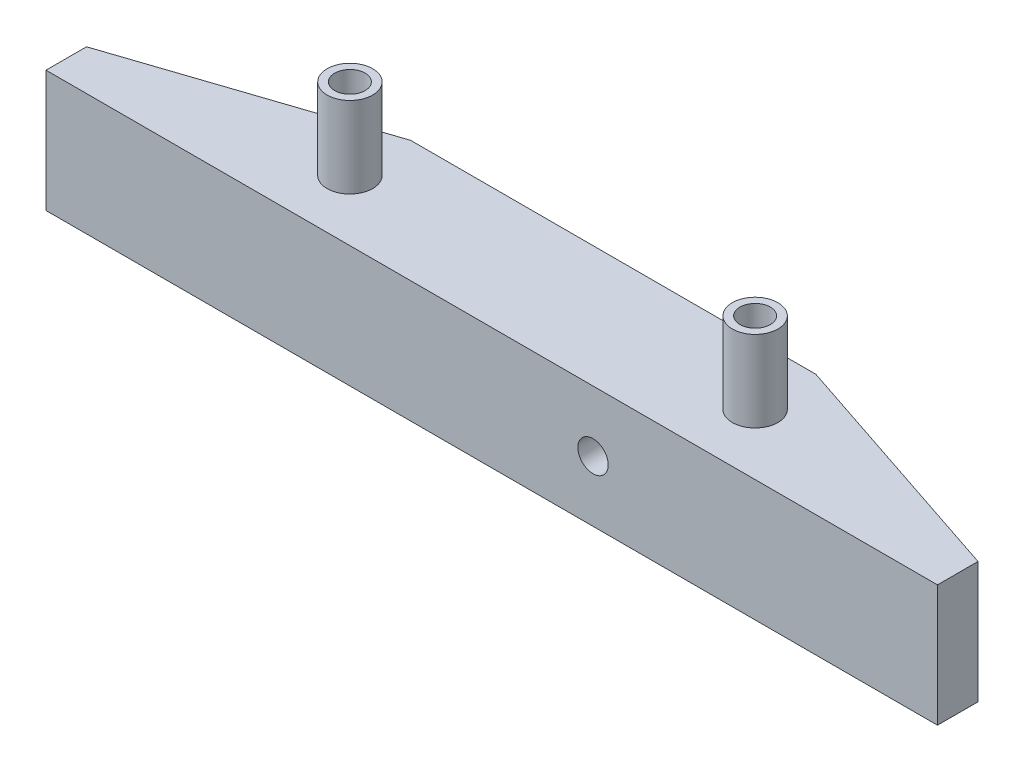
ISO-10303-21;
HEADER;
FILE_DESCRIPTION(('STEP AP214'),'2;1');
FILE_NAME('part.step','',(''),(''),'','','');
FILE_SCHEMA(('AUTOMOTIVE_DESIGN { 1 0 10303 214 1 1 1 1 }'));
ENDSEC;
DATA;
#1=APPLICATION_CONTEXT('core data for automotive mechanical design processes');
#2=APPLICATION_PROTOCOL_DEFINITION('international standard','automotive_design',2000,#1);
#3=PRODUCT_CONTEXT('',#1,'mechanical');
#4=PRODUCT('Part','Part','',(#3));
#5=PRODUCT_RELATED_PRODUCT_CATEGORY('part','',(#4));
#6=PRODUCT_DEFINITION_FORMATION('','',#4);
#7=PRODUCT_DEFINITION_CONTEXT('part definition',#1,'design');
#8=PRODUCT_DEFINITION('design','',#6,#7);
#9=PRODUCT_DEFINITION_SHAPE('','',#8);
#10=(LENGTH_UNIT() NAMED_UNIT(*) SI_UNIT(.MILLI.,.METRE.));
#11=(NAMED_UNIT(*) PLANE_ANGLE_UNIT() SI_UNIT($,.RADIAN.));
#12=(NAMED_UNIT(*) SI_UNIT($,.STERADIAN.) SOLID_ANGLE_UNIT());
#13=UNCERTAINTY_MEASURE_WITH_UNIT(LENGTH_MEASURE(1.E-05),#10,'distance_accuracy_value','');
#14=(GEOMETRIC_REPRESENTATION_CONTEXT(3) GLOBAL_UNCERTAINTY_ASSIGNED_CONTEXT((#13)) GLOBAL_UNIT_ASSIGNED_CONTEXT((#10,
#11,#12)) REPRESENTATION_CONTEXT('',''));
#15=CARTESIAN_POINT('',(0.,0.,0.));
#16=DIRECTION('',(0.,0.,1.));
#17=DIRECTION('',(1.,0.,0.));
#18=AXIS2_PLACEMENT_3D('',#15,#16,#17);
#19=CARTESIAN_POINT('',(0.,12.,-4.));
#20=DIRECTION('',(1.,0.,0.));
#21=DIRECTION('',(0.,0.,-1.));
#22=AXIS2_PLACEMENT_3D('',#19,#20,#21);
#23=PLANE('',#22);
#24=DIRECTION('',(0.,0.,1.));
#25=VECTOR('',#24,1.);
#26=CARTESIAN_POINT('',(0.,0.,-4.));
#27=LINE('',#26,#25);
#28=CARTESIAN_POINT('',(0.,0.,-4.));
#29=VERTEX_POINT('',#28);
#30=CARTESIAN_POINT('',(0.,0.,0.));
#31=VERTEX_POINT('',#30);
#32=EDGE_CURVE('E123',#29,#31,#27,.T.);
#33=ORIENTED_EDGE('',*,*,#32,.T.);
#34=DIRECTION('',(0.,-1.,0.));
#35=VECTOR('',#34,1.);
#36=CARTESIAN_POINT('',(0.,12.,0.));
#37=LINE('',#36,#35);
#38=CARTESIAN_POINT('',(0.,12.,0.));
#39=VERTEX_POINT('',#38);
#40=EDGE_CURVE('E11',#39,#31,#37,.T.);
#41=ORIENTED_EDGE('',*,*,#40,.F.);
#42=DIRECTION('',(0.,0.,1.));
#43=VECTOR('',#42,1.);
#44=CARTESIAN_POINT('',(0.,12.,-4.));
#45=LINE('',#44,#43);
#46=CARTESIAN_POINT('',(0.,12.,-4.));
#47=VERTEX_POINT('',#46);
#48=EDGE_CURVE('E134',#47,#39,#45,.T.);
#49=ORIENTED_EDGE('',*,*,#48,.F.);
#50=DIRECTION('',(0.,-1.,0.));
#51=VECTOR('',#50,1.);
#52=CARTESIAN_POINT('',(0.,12.,-4.));
#53=LINE('',#52,#51);
#54=EDGE_CURVE('E119',#47,#29,#53,.T.);
#55=ORIENTED_EDGE('',*,*,#54,.T.);
#56=EDGE_LOOP('',(#33,#41,#49,#55));
#57=FACE_BOUND('',#56,.T.);
#58=ADVANCED_FACE('F39',(#57),#23,.F.);
#59=CARTESIAN_POINT('',(0.,12.,0.));
#60=DIRECTION('',(0.,0.,-1.));
#61=DIRECTION('',(-1.,0.,0.));
#62=AXIS2_PLACEMENT_3D('',#59,#60,#61);
#63=PLANE('',#62);
#64=CARTESIAN_POINT('',(54.,6.,0.));
#65=DIRECTION('',(0.,0.,-1.));
#66=DIRECTION('',(-1.,0.,0.));
#67=AXIS2_PLACEMENT_3D('',#64,#65,#66);
#68=CIRCLE('',#67,1.5);
#69=CARTESIAN_POINT('',(52.5,6.,0.));
#70=VERTEX_POINT('',#69);
#71=EDGE_CURVE('E446',#70,#70,#68,.T.);
#72=ORIENTED_EDGE('',*,*,#71,.T.);
#73=EDGE_LOOP('',(#72));
#74=FACE_BOUND('',#73,.T.);
#75=DIRECTION('',(1.,0.,0.));
#76=VECTOR('',#75,1.);
#77=CARTESIAN_POINT('',(0.,0.,0.));
#78=LINE('',#77,#76);
#79=CARTESIAN_POINT('',(88.,0.,0.));
#80=VERTEX_POINT('',#79);
#81=EDGE_CURVE('E126',#31,#80,#78,.T.);
#82=ORIENTED_EDGE('',*,*,#81,.T.);
#83=DIRECTION('',(0.,-1.,0.));
#84=VECTOR('',#83,1.);
#85=CARTESIAN_POINT('',(88.,12.,0.));
#86=LINE('',#85,#84);
#87=CARTESIAN_POINT('',(88.,12.,0.));
#88=VERTEX_POINT('',#87);
#89=EDGE_CURVE('E47',#88,#80,#86,.T.);
#90=ORIENTED_EDGE('',*,*,#89,.F.);
#91=DIRECTION('',(1.,0.,0.));
#92=VECTOR('',#91,1.);
#93=CARTESIAN_POINT('',(0.,12.,0.));
#94=LINE('',#93,#92);
#95=EDGE_CURVE('E92',#39,#88,#94,.T.);
#96=ORIENTED_EDGE('',*,*,#95,.F.);
#97=ORIENTED_EDGE('',*,*,#40,.T.);
#98=EDGE_LOOP('',(#82,#90,#96,#97));
#99=FACE_BOUND('',#98,.T.);
#100=ADVANCED_FACE('F160',(#74,#99),#63,.F.);
#101=CARTESIAN_POINT('',(88.,12.,0.));
#102=DIRECTION('',(-1.,0.,0.));
#103=DIRECTION('',(0.,0.,1.));
#104=AXIS2_PLACEMENT_3D('',#101,#102,#103);
#105=PLANE('',#104);
#106=DIRECTION('',(0.,0.,-1.));
#107=VECTOR('',#106,1.);
#108=CARTESIAN_POINT('',(88.,0.,0.));
#109=LINE('',#108,#107);
#110=CARTESIAN_POINT('',(88.,0.,-4.));
#111=VERTEX_POINT('',#110);
#112=EDGE_CURVE('E129',#80,#111,#109,.T.);
#113=ORIENTED_EDGE('',*,*,#112,.T.);
#114=DIRECTION('',(0.,-1.,0.));
#115=VECTOR('',#114,1.);
#116=CARTESIAN_POINT('',(88.,12.,-4.));
#117=LINE('',#116,#115);
#118=CARTESIAN_POINT('',(88.,12.,-4.));
#119=VERTEX_POINT('',#118);
#120=EDGE_CURVE('E114',#119,#111,#117,.T.);
#121=ORIENTED_EDGE('',*,*,#120,.F.);
#122=DIRECTION('',(0.,0.,-1.));
#123=VECTOR('',#122,1.);
#124=CARTESIAN_POINT('',(88.,12.,0.));
#125=LINE('',#124,#123);
#126=EDGE_CURVE('E105',#88,#119,#125,.T.);
#127=ORIENTED_EDGE('',*,*,#126,.F.);
#128=ORIENTED_EDGE('',*,*,#89,.T.);
#129=EDGE_LOOP('',(#113,#121,#127,#128));
#130=FACE_BOUND('',#129,.T.);
#131=ADVANCED_FACE('F140',(#130),#105,.F.);
#132=CARTESIAN_POINT('',(88.,12.,-4.));
#133=DIRECTION('',(-0.316227766016838,0.,0.948683298050514));
#134=DIRECTION('',(0.948683298050514,0.,0.316227766016838));
#135=AXIS2_PLACEMENT_3D('',#132,#133,#134);
#136=PLANE('',#135);
#137=DIRECTION('',(-0.948683298050514,0.,-0.316227766016838));
#138=VECTOR('',#137,1.);
#139=CARTESIAN_POINT('',(88.,0.,-4.));
#140=LINE('',#139,#138);
#141=CARTESIAN_POINT('',(64.,0.,-12.));
#142=VERTEX_POINT('',#141);
#143=EDGE_CURVE('E113',#111,#142,#140,.T.);
#144=ORIENTED_EDGE('',*,*,#143,.T.);
#145=DIRECTION('',(0.,-1.,0.));
#146=VECTOR('',#145,1.);
#147=CARTESIAN_POINT('',(64.,12.,-12.));
#148=LINE('',#147,#146);
#149=CARTESIAN_POINT('',(64.,12.,-12.));
#150=VERTEX_POINT('',#149);
#151=EDGE_CURVE('E110',#150,#142,#148,.T.);
#152=ORIENTED_EDGE('',*,*,#151,.F.);
#153=DIRECTION('',(-0.948683298050514,0.,-0.316227766016838));
#154=VECTOR('',#153,1.);
#155=CARTESIAN_POINT('',(88.,12.,-4.));
#156=LINE('',#155,#154);
#157=EDGE_CURVE('E99',#119,#150,#156,.T.);
#158=ORIENTED_EDGE('',*,*,#157,.F.);
#159=ORIENTED_EDGE('',*,*,#120,.T.);
#160=EDGE_LOOP('',(#144,#152,#158,#159));
#161=FACE_BOUND('',#160,.T.);
#162=ADVANCED_FACE('F111',(#161),#136,.F.);
#163=CARTESIAN_POINT('',(64.,12.,-12.));
#164=DIRECTION('',(0.,0.,1.));
#165=DIRECTION('',(1.,0.,0.));
#166=AXIS2_PLACEMENT_3D('',#163,#164,#165);
#167=PLANE('',#166);
#168=CARTESIAN_POINT('',(54.,6.,-12.));
#169=DIRECTION('',(0.,0.,-1.));
#170=DIRECTION('',(-1.,0.,0.));
#171=AXIS2_PLACEMENT_3D('',#168,#169,#170);
#172=CIRCLE('',#171,5.);
#173=CARTESIAN_POINT('',(49.,6.,-12.));
#174=VERTEX_POINT('',#173);
#175=EDGE_CURVE('E443',#174,#174,#172,.T.);
#176=ORIENTED_EDGE('',*,*,#175,.F.);
#177=EDGE_LOOP('',(#176));
#178=FACE_BOUND('',#177,.T.);
#179=DIRECTION('',(-1.,0.,0.));
#180=VECTOR('',#179,1.);
#181=CARTESIAN_POINT('',(64.,0.,-12.));
#182=LINE('',#181,#180);
#183=CARTESIAN_POINT('',(24.,0.,-12.));
#184=VERTEX_POINT('',#183);
#185=EDGE_CURVE('E78',#142,#184,#182,.T.);
#186=ORIENTED_EDGE('',*,*,#185,.T.);
#187=DIRECTION('',(0.,-1.,0.));
#188=VECTOR('',#187,1.);
#189=CARTESIAN_POINT('',(24.,12.,-12.));
#190=LINE('',#189,#188);
#191=CARTESIAN_POINT('',(24.,12.,-12.));
#192=VERTEX_POINT('',#191);
#193=EDGE_CURVE('E115',#192,#184,#190,.T.);
#194=ORIENTED_EDGE('',*,*,#193,.F.);
#195=DIRECTION('',(-1.,0.,0.));
#196=VECTOR('',#195,1.);
#197=CARTESIAN_POINT('',(64.,12.,-12.));
#198=LINE('',#197,#196);
#199=EDGE_CURVE('E103',#150,#192,#198,.T.);
#200=ORIENTED_EDGE('',*,*,#199,.F.);
#201=ORIENTED_EDGE('',*,*,#151,.T.);
#202=EDGE_LOOP('',(#186,#194,#200,#201));
#203=FACE_BOUND('',#202,.T.);
#204=ADVANCED_FACE('F117',(#178,#203),#167,.F.);
#205=CARTESIAN_POINT('',(24.,12.,-12.));
#206=DIRECTION('',(0.316227766016838,0.,0.948683298050514));
#207=DIRECTION('',(0.948683298050514,0.,-0.316227766016838));
#208=AXIS2_PLACEMENT_3D('',#205,#206,#207);
#209=PLANE('',#208);
#210=DIRECTION('',(-0.948683298050514,0.,0.316227766016838));
#211=VECTOR('',#210,1.);
#212=CARTESIAN_POINT('',(24.,0.,-12.));
#213=LINE('',#212,#211);
#214=EDGE_CURVE('E84',#184,#29,#213,.T.);
#215=ORIENTED_EDGE('',*,*,#214,.T.);
#216=ORIENTED_EDGE('',*,*,#54,.F.);
#217=DIRECTION('',(-0.948683298050514,0.,0.316227766016838));
#218=VECTOR('',#217,1.);
#219=CARTESIAN_POINT('',(24.,12.,-12.));
#220=LINE('',#219,#218);
#221=EDGE_CURVE('E55',#192,#47,#220,.T.);
#222=ORIENTED_EDGE('',*,*,#221,.F.);
#223=ORIENTED_EDGE('',*,*,#193,.T.);
#224=EDGE_LOOP('',(#215,#216,#222,#223));
#225=FACE_BOUND('',#224,.T.);
#226=ADVANCED_FACE('F147',(#225),#209,.F.);
#227=CARTESIAN_POINT('',(0.,12.,0.));
#228=DIRECTION('',(0.,1.,0.));
#229=DIRECTION('',(0.,0.,1.));
#230=AXIS2_PLACEMENT_3D('',#227,#228,#229);
#231=PLANE('',#230);
#232=CARTESIAN_POINT('',(64.,12.,-5.99999999999996));
#233=DIRECTION('',(0.,1.,0.));
#234=DIRECTION('',(0.,0.,1.));
#235=AXIS2_PLACEMENT_3D('',#232,#233,#234);
#236=CIRCLE('',#235,2.25);
#237=CARTESIAN_POINT('',(64.,12.,-3.74999999999996));
#238=VERTEX_POINT('',#237);
#239=EDGE_CURVE('E434',#238,#238,#236,.T.);
#240=ORIENTED_EDGE('',*,*,#239,.F.);
#241=EDGE_LOOP('',(#240));
#242=FACE_BOUND('',#241,.T.);
#243=CARTESIAN_POINT('',(24.,12.,-5.99999999999996));
#244=DIRECTION('',(0.,1.,0.));
#245=DIRECTION('',(0.,0.,1.));
#246=AXIS2_PLACEMENT_3D('',#243,#244,#245);
#247=CIRCLE('',#246,2.25);
#248=CARTESIAN_POINT('',(24.,12.,-3.74999999999996));
#249=VERTEX_POINT('',#248);
#250=EDGE_CURVE('E425',#249,#249,#247,.T.);
#251=ORIENTED_EDGE('',*,*,#250,.F.);
#252=EDGE_LOOP('',(#251));
#253=FACE_BOUND('',#252,.T.);
#254=ORIENTED_EDGE('',*,*,#48,.T.);
#255=ORIENTED_EDGE('',*,*,#95,.T.);
#256=ORIENTED_EDGE('',*,*,#126,.T.);
#257=ORIENTED_EDGE('',*,*,#157,.T.);
#258=ORIENTED_EDGE('',*,*,#199,.T.);
#259=ORIENTED_EDGE('',*,*,#221,.T.);
#260=EDGE_LOOP('',(#254,#255,#256,#257,#258,#259));
#261=FACE_BOUND('',#260,.T.);
#262=ADVANCED_FACE('F101',(#242,#253,#261),#231,.T.);
#263=CARTESIAN_POINT('',(0.,0.,0.));
#264=DIRECTION('',(0.,1.,0.));
#265=DIRECTION('',(0.,0.,1.));
#266=AXIS2_PLACEMENT_3D('',#263,#264,#265);
#267=PLANE('',#266);
#268=CARTESIAN_POINT('',(24.,0.,-5.99999999999996));
#269=DIRECTION('',(0.,-1.,0.));
#270=DIRECTION('',(0.,0.,-1.));
#271=AXIS2_PLACEMENT_3D('',#268,#269,#270);
#272=CIRCLE('',#271,2.5);
#273=CARTESIAN_POINT('',(24.,0.,-8.49999999999996));
#274=VERTEX_POINT('',#273);
#275=EDGE_CURVE('E403',#274,#274,#272,.T.);
#276=ORIENTED_EDGE('',*,*,#275,.F.);
#277=EDGE_LOOP('',(#276));
#278=FACE_BOUND('',#277,.T.);
#279=CARTESIAN_POINT('',(64.,0.,-5.99999999999996));
#280=DIRECTION('',(0.,-1.,0.));
#281=DIRECTION('',(0.,0.,-1.));
#282=AXIS2_PLACEMENT_3D('',#279,#280,#281);
#283=CIRCLE('',#282,2.5);
#284=CARTESIAN_POINT('',(64.,0.,-8.49999999999996));
#285=VERTEX_POINT('',#284);
#286=EDGE_CURVE('E406',#285,#285,#283,.T.);
#287=ORIENTED_EDGE('',*,*,#286,.F.);
#288=EDGE_LOOP('',(#287));
#289=FACE_BOUND('',#288,.T.);
#290=ORIENTED_EDGE('',*,*,#32,.F.);
#291=ORIENTED_EDGE('',*,*,#214,.F.);
#292=ORIENTED_EDGE('',*,*,#185,.F.);
#293=ORIENTED_EDGE('',*,*,#143,.F.);
#294=ORIENTED_EDGE('',*,*,#112,.F.);
#295=ORIENTED_EDGE('',*,*,#81,.F.);
#296=EDGE_LOOP('',(#290,#291,#292,#293,#294,#295));
#297=FACE_BOUND('',#296,.T.);
#298=ADVANCED_FACE('F143',(#278,#289,#297),#267,.F.);
#299=CARTESIAN_POINT('',(64.,5.,-5.99999999999996));
#300=DIRECTION('',(0.,-1.,0.));
#301=DIRECTION('',(0.,0.,-1.));
#302=AXIS2_PLACEMENT_3D('',#299,#300,#301);
#303=CYLINDRICAL_SURFACE('',#302,2.5);
#304=CARTESIAN_POINT('',(64.,5.,-5.99999999999996));
#305=DIRECTION('',(0.,-1.,0.));
#306=DIRECTION('',(0.,0.,-1.));
#307=AXIS2_PLACEMENT_3D('',#304,#305,#306);
#308=CIRCLE('',#307,2.5);
#309=CARTESIAN_POINT('',(64.,5.,-8.49999999999996));
#310=VERTEX_POINT('',#309);
#311=EDGE_CURVE('E408',#310,#310,#308,.T.);
#312=ORIENTED_EDGE('',*,*,#311,.F.);
#313=EDGE_LOOP('',(#312));
#314=FACE_BOUND('',#313,.T.);
#315=ORIENTED_EDGE('',*,*,#286,.T.);
#316=EDGE_LOOP('',(#315));
#317=FACE_BOUND('',#316,.T.);
#318=ADVANCED_FACE('F317',(#314,#317),#303,.F.);
#319=CARTESIAN_POINT('',(64.,5.,-5.99999999999996));
#320=DIRECTION('',(0.,-1.,0.));
#321=DIRECTION('',(0.,0.,-1.));
#322=AXIS2_PLACEMENT_3D('',#319,#320,#321);
#323=PLANE('',#322);
#324=CARTESIAN_POINT('',(64.,5.,-5.99999999999996));
#325=DIRECTION('',(0.,-1.,0.));
#326=DIRECTION('',(0.,0.,-1.));
#327=AXIS2_PLACEMENT_3D('',#324,#325,#326);
#328=CIRCLE('',#327,1.5);
#329=CARTESIAN_POINT('',(64.,5.,-7.49999999999995));
#330=VERTEX_POINT('',#329);
#331=EDGE_CURVE('E419',#330,#330,#328,.T.);
#332=ORIENTED_EDGE('',*,*,#331,.F.);
#333=EDGE_LOOP('',(#332));
#334=FACE_BOUND('',#333,.T.);
#335=ORIENTED_EDGE('',*,*,#311,.T.);
#336=EDGE_LOOP('',(#335));
#337=FACE_BOUND('',#336,.T.);
#338=ADVANCED_FACE('F307',(#334,#337),#323,.T.);
#339=CARTESIAN_POINT('',(24.,5.,-5.99999999999996));
#340=DIRECTION('',(0.,-1.,0.));
#341=DIRECTION('',(0.,0.,-1.));
#342=AXIS2_PLACEMENT_3D('',#339,#340,#341);
#343=CYLINDRICAL_SURFACE('',#342,2.5);
#344=CARTESIAN_POINT('',(24.,5.,-5.99999999999996));
#345=DIRECTION('',(0.,-1.,0.));
#346=DIRECTION('',(0.,0.,-1.));
#347=AXIS2_PLACEMENT_3D('',#344,#345,#346);
#348=CIRCLE('',#347,2.5);
#349=CARTESIAN_POINT('',(24.,5.,-8.49999999999996));
#350=VERTEX_POINT('',#349);
#351=EDGE_CURVE('E127',#350,#350,#348,.T.);
#352=ORIENTED_EDGE('',*,*,#351,.F.);
#353=EDGE_LOOP('',(#352));
#354=FACE_BOUND('',#353,.T.);
#355=ORIENTED_EDGE('',*,*,#275,.T.);
#356=EDGE_LOOP('',(#355));
#357=FACE_BOUND('',#356,.T.);
#358=ADVANCED_FACE('F297',(#354,#357),#343,.F.);
#359=CARTESIAN_POINT('',(24.,5.,-5.99999999999996));
#360=DIRECTION('',(0.,-1.,0.));
#361=DIRECTION('',(0.,0.,-1.));
#362=AXIS2_PLACEMENT_3D('',#359,#360,#361);
#363=PLANE('',#362);
#364=CARTESIAN_POINT('',(24.,5.,-5.99999999999996));
#365=DIRECTION('',(0.,-1.,0.));
#366=DIRECTION('',(0.,0.,-1.));
#367=AXIS2_PLACEMENT_3D('',#364,#365,#366);
#368=CIRCLE('',#367,1.5);
#369=CARTESIAN_POINT('',(24.,5.,-7.49999999999996));
#370=VERTEX_POINT('',#369);
#371=EDGE_CURVE('E412',#370,#370,#368,.T.);
#372=ORIENTED_EDGE('',*,*,#371,.F.);
#373=EDGE_LOOP('',(#372));
#374=FACE_BOUND('',#373,.T.);
#375=ORIENTED_EDGE('',*,*,#351,.T.);
#376=EDGE_LOOP('',(#375));
#377=FACE_BOUND('',#376,.T.);
#378=ADVANCED_FACE('F288',(#374,#377),#363,.T.);
#379=CARTESIAN_POINT('',(64.,12.,-5.99999999999996));
#380=DIRECTION('',(0.,-1.,0.));
#381=DIRECTION('',(0.,0.,-1.));
#382=AXIS2_PLACEMENT_3D('',#379,#380,#381);
#383=CYLINDRICAL_SURFACE('',#382,1.5);
#384=ORIENTED_EDGE('',*,*,#331,.T.);
#385=EDGE_LOOP('',(#384));
#386=FACE_BOUND('',#385,.T.);
#387=CARTESIAN_POINT('',(64.,20.,-5.99999999999996));
#388=DIRECTION('',(0.,1.,0.));
#389=DIRECTION('',(0.,0.,1.));
#390=AXIS2_PLACEMENT_3D('',#387,#388,#389);
#391=CIRCLE('',#390,1.5);
#392=CARTESIAN_POINT('',(64.,20.,-4.49999999999996));
#393=VERTEX_POINT('',#392);
#394=EDGE_CURVE('E437',#393,#393,#391,.F.);
#395=ORIENTED_EDGE('',*,*,#394,.F.);
#396=EDGE_LOOP('',(#395));
#397=FACE_BOUND('',#396,.T.);
#398=ADVANCED_FACE('F277',(#386,#397),#383,.F.);
#399=CARTESIAN_POINT('',(24.,12.,-5.99999999999996));
#400=DIRECTION('',(0.,-1.,0.));
#401=DIRECTION('',(0.,0.,-1.));
#402=AXIS2_PLACEMENT_3D('',#399,#400,#401);
#403=CYLINDRICAL_SURFACE('',#402,1.5);
#404=ORIENTED_EDGE('',*,*,#371,.T.);
#405=EDGE_LOOP('',(#404));
#406=FACE_BOUND('',#405,.T.);
#407=CARTESIAN_POINT('',(24.,20.,-5.99999999999996));
#408=DIRECTION('',(0.,1.,0.));
#409=DIRECTION('',(0.,0.,1.));
#410=AXIS2_PLACEMENT_3D('',#407,#408,#409);
#411=CIRCLE('',#410,1.5);
#412=CARTESIAN_POINT('',(24.,20.,-4.49999999999996));
#413=VERTEX_POINT('',#412);
#414=EDGE_CURVE('E428',#413,#413,#411,.F.);
#415=ORIENTED_EDGE('',*,*,#414,.F.);
#416=EDGE_LOOP('',(#415));
#417=FACE_BOUND('',#416,.T.);
#418=ADVANCED_FACE('F266',(#406,#417),#403,.F.);
#419=CARTESIAN_POINT('',(24.,20.,-5.99999999999996));
#420=DIRECTION('',(0.,-1.,0.));
#421=DIRECTION('',(0.,0.,-1.));
#422=AXIS2_PLACEMENT_3D('',#419,#420,#421);
#423=CYLINDRICAL_SURFACE('',#422,2.25);
#424=CARTESIAN_POINT('',(24.,20.,-5.99999999999996));
#425=DIRECTION('',(0.,1.,0.));
#426=DIRECTION('',(0.,0.,1.));
#427=AXIS2_PLACEMENT_3D('',#424,#425,#426);
#428=CIRCLE('',#427,2.25);
#429=CARTESIAN_POINT('',(24.,20.,-3.74999999999996));
#430=VERTEX_POINT('',#429);
#431=EDGE_CURVE('E422',#430,#430,#428,.T.);
#432=ORIENTED_EDGE('',*,*,#431,.F.);
#433=EDGE_LOOP('',(#432));
#434=FACE_BOUND('',#433,.T.);
#435=ORIENTED_EDGE('',*,*,#250,.T.);
#436=EDGE_LOOP('',(#435));
#437=FACE_BOUND('',#436,.T.);
#438=ADVANCED_FACE('F256',(#434,#437),#423,.T.);
#439=CARTESIAN_POINT('',(0.,20.,0.));
#440=DIRECTION('',(0.,1.,0.));
#441=DIRECTION('',(0.,0.,1.));
#442=AXIS2_PLACEMENT_3D('',#439,#440,#441);
#443=PLANE('',#442);
#444=ORIENTED_EDGE('',*,*,#414,.T.);
#445=EDGE_LOOP('',(#444));
#446=FACE_BOUND('',#445,.T.);
#447=ORIENTED_EDGE('',*,*,#431,.T.);
#448=EDGE_LOOP('',(#447));
#449=FACE_BOUND('',#448,.T.);
#450=ADVANCED_FACE('F247',(#446,#449),#443,.T.);
#451=CARTESIAN_POINT('',(64.,20.,-5.99999999999996));
#452=DIRECTION('',(0.,-1.,0.));
#453=DIRECTION('',(0.,0.,-1.));
#454=AXIS2_PLACEMENT_3D('',#451,#452,#453);
#455=CYLINDRICAL_SURFACE('',#454,2.25);
#456=CARTESIAN_POINT('',(64.,20.,-5.99999999999996));
#457=DIRECTION('',(0.,1.,0.));
#458=DIRECTION('',(0.,0.,1.));
#459=AXIS2_PLACEMENT_3D('',#456,#457,#458);
#460=CIRCLE('',#459,2.25);
#461=CARTESIAN_POINT('',(64.,20.,-3.74999999999996));
#462=VERTEX_POINT('',#461);
#463=EDGE_CURVE('E429',#462,#462,#460,.T.);
#464=ORIENTED_EDGE('',*,*,#463,.F.);
#465=EDGE_LOOP('',(#464));
#466=FACE_BOUND('',#465,.T.);
#467=ORIENTED_EDGE('',*,*,#239,.T.);
#468=EDGE_LOOP('',(#467));
#469=FACE_BOUND('',#468,.T.);
#470=ADVANCED_FACE('F238',(#466,#469),#455,.T.);
#471=CARTESIAN_POINT('',(0.,20.,0.));
#472=DIRECTION('',(0.,1.,0.));
#473=DIRECTION('',(0.,0.,1.));
#474=AXIS2_PLACEMENT_3D('',#471,#472,#473);
#475=PLANE('',#474);
#476=ORIENTED_EDGE('',*,*,#394,.T.);
#477=EDGE_LOOP('',(#476));
#478=FACE_BOUND('',#477,.T.);
#479=ORIENTED_EDGE('',*,*,#463,.T.);
#480=EDGE_LOOP('',(#479));
#481=FACE_BOUND('',#480,.T.);
#482=ADVANCED_FACE('F188',(#478,#481),#475,.T.);
#483=CARTESIAN_POINT('',(54.,6.,-8.99999999999999));
#484=DIRECTION('',(0.,0.,-1.));
#485=DIRECTION('',(-1.,0.,0.));
#486=AXIS2_PLACEMENT_3D('',#483,#484,#485);
#487=CYLINDRICAL_SURFACE('',#486,5.);
#488=CARTESIAN_POINT('',(54.,6.,-8.99999999999999));
#489=DIRECTION('',(0.,0.,-1.));
#490=DIRECTION('',(-1.,0.,0.));
#491=AXIS2_PLACEMENT_3D('',#488,#489,#490);
#492=CIRCLE('',#491,5.);
#493=CARTESIAN_POINT('',(49.,6.,-8.99999999999999));
#494=VERTEX_POINT('',#493);
#495=EDGE_CURVE('E438',#494,#494,#492,.T.);
#496=ORIENTED_EDGE('',*,*,#495,.F.);
#497=EDGE_LOOP('',(#496));
#498=FACE_BOUND('',#497,.T.);
#499=ORIENTED_EDGE('',*,*,#175,.T.);
#500=EDGE_LOOP('',(#499));
#501=FACE_BOUND('',#500,.T.);
#502=ADVANCED_FACE('F193',(#498,#501),#487,.F.);
#503=CARTESIAN_POINT('',(54.,6.,-8.99999999999999));
#504=DIRECTION('',(0.,0.,-1.));
#505=DIRECTION('',(-1.,0.,0.));
#506=AXIS2_PLACEMENT_3D('',#503,#504,#505);
#507=PLANE('',#506);
#508=CARTESIAN_POINT('',(54.,6.,-8.99999999999999));
#509=DIRECTION('',(0.,0.,-1.));
#510=DIRECTION('',(-1.,0.,0.));
#511=AXIS2_PLACEMENT_3D('',#508,#509,#510);
#512=CIRCLE('',#511,1.5);
#513=CARTESIAN_POINT('',(52.5,6.,-8.99999999999999));
#514=VERTEX_POINT('',#513);
#515=EDGE_CURVE('E449',#514,#514,#512,.T.);
#516=ORIENTED_EDGE('',*,*,#515,.F.);
#517=EDGE_LOOP('',(#516));
#518=FACE_BOUND('',#517,.T.);
#519=ORIENTED_EDGE('',*,*,#495,.T.);
#520=EDGE_LOOP('',(#519));
#521=FACE_BOUND('',#520,.T.);
#522=ADVANCED_FACE('F197',(#518,#521),#507,.T.);
#523=CARTESIAN_POINT('',(54.,6.,0.));
#524=DIRECTION('',(0.,0.,-1.));
#525=DIRECTION('',(-1.,0.,0.));
#526=AXIS2_PLACEMENT_3D('',#523,#524,#525);
#527=CYLINDRICAL_SURFACE('',#526,1.5);
#528=ORIENTED_EDGE('',*,*,#71,.F.);
#529=EDGE_LOOP('',(#528));
#530=FACE_BOUND('',#529,.T.);
#531=ORIENTED_EDGE('',*,*,#515,.T.);
#532=EDGE_LOOP('',(#531));
#533=FACE_BOUND('',#532,.T.);
#534=ADVANCED_FACE('F216',(#530,#533),#527,.F.);
#535=CLOSED_SHELL('',(#58,#100,#131,#162,#204,#226,#262,#298,#318,#338,#358,#378,#398,#418,#438,
#450,#470,#482,#502,#522,#534));
#536=MANIFOLD_SOLID_BREP('B2',#535);
#537=ADVANCED_BREP_SHAPE_REPRESENTATION('',(#18,#536),#14);
#538=SHAPE_DEFINITION_REPRESENTATION(#9,#537);
ENDSEC;
END-ISO-10303-21;
